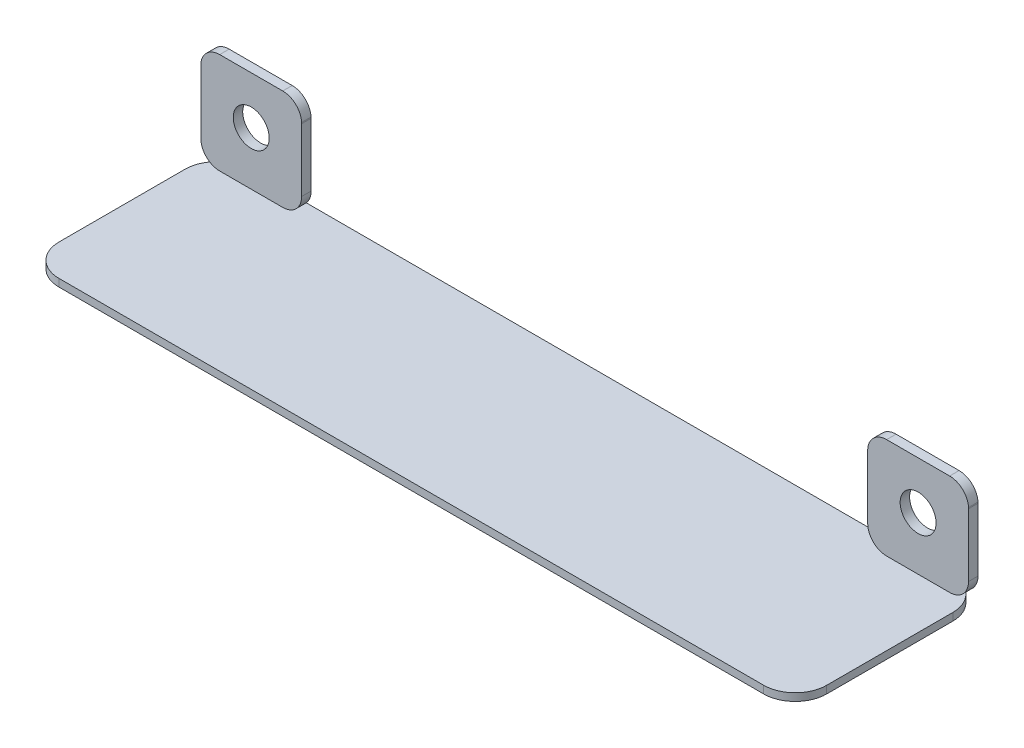
ISO-10303-21;
HEADER;
FILE_DESCRIPTION(('STEP AP214'),'2;1');
FILE_NAME('part.step','',(''),(''),'','','');
FILE_SCHEMA(('AUTOMOTIVE_DESIGN { 1 0 10303 214 1 1 1 1 }'));
ENDSEC;
DATA;
#1=APPLICATION_CONTEXT('core data for automotive mechanical design processes');
#2=APPLICATION_PROTOCOL_DEFINITION('international standard','automotive_design',2000,#1);
#3=PRODUCT_CONTEXT('',#1,'mechanical');
#4=PRODUCT('Part','Part','',(#3));
#5=PRODUCT_RELATED_PRODUCT_CATEGORY('part','',(#4));
#6=PRODUCT_DEFINITION_FORMATION('','',#4);
#7=PRODUCT_DEFINITION_CONTEXT('part definition',#1,'design');
#8=PRODUCT_DEFINITION('design','',#6,#7);
#9=PRODUCT_DEFINITION_SHAPE('','',#8);
#10=(LENGTH_UNIT() NAMED_UNIT(*) SI_UNIT(.MILLI.,.METRE.));
#11=(NAMED_UNIT(*) PLANE_ANGLE_UNIT() SI_UNIT($,.RADIAN.));
#12=(NAMED_UNIT(*) SI_UNIT($,.STERADIAN.) SOLID_ANGLE_UNIT());
#13=UNCERTAINTY_MEASURE_WITH_UNIT(LENGTH_MEASURE(1.E-05),#10,'distance_accuracy_value','');
#14=(GEOMETRIC_REPRESENTATION_CONTEXT(3) GLOBAL_UNCERTAINTY_ASSIGNED_CONTEXT((#13)) GLOBAL_UNIT_ASSIGNED_CONTEXT((#10,
#11,#12)) REPRESENTATION_CONTEXT('',''));
#15=CARTESIAN_POINT('',(0.,0.,0.));
#16=DIRECTION('',(0.,0.,1.));
#17=DIRECTION('',(1.,0.,0.));
#18=AXIS2_PLACEMENT_3D('',#15,#16,#17);
#19=CARTESIAN_POINT('',(0.,-56.3999999999996,0.));
#20=DIRECTION('',(0.,1.,0.));
#21=DIRECTION('',(0.,0.,1.));
#22=AXIS2_PLACEMENT_3D('',#19,#20,#21);
#23=PLANE('',#22);
#24=DIRECTION('',(-1.,0.,0.));
#25=VECTOR('',#24,1.);
#26=CARTESIAN_POINT('',(-7.9999999999992,-56.3999999999996,29.));
#27=LINE('',#26,#25);
#28=CARTESIAN_POINT('',(108.800000000001,-56.3999999999996,29.));
#29=VERTEX_POINT('',#28);
#30=CARTESIAN_POINT('',(-2.9999999999992,-56.3999999999996,29.));
#31=VERTEX_POINT('',#30);
#32=EDGE_CURVE('E318',#29,#31,#27,.T.);
#33=ORIENTED_EDGE('',*,*,#32,.F.);
#34=CARTESIAN_POINT('',(108.800000000001,-56.3999999999996,24.));
#35=DIRECTION('',(0.,1.,0.));
#36=DIRECTION('',(0.,0.,1.));
#37=AXIS2_PLACEMENT_3D('',#34,#35,#36);
#38=CIRCLE('',#37,5.);
#39=CARTESIAN_POINT('',(113.800000000001,-56.3999999999996,24.));
#40=VERTEX_POINT('',#39);
#41=EDGE_CURVE('E424',#29,#40,#38,.T.);
#42=ORIENTED_EDGE('',*,*,#41,.T.);
#43=DIRECTION('',(0.,0.,1.));
#44=VECTOR('',#43,1.);
#45=CARTESIAN_POINT('',(113.800000000001,-56.3999999999996,-0.999999999999986));
#46=LINE('',#45,#44);
#47=CARTESIAN_POINT('',(113.800000000001,-56.3999999999996,4.00000000000001));
#48=VERTEX_POINT('',#47);
#49=EDGE_CURVE('E331',#48,#40,#46,.T.);
#50=ORIENTED_EDGE('',*,*,#49,.F.);
#51=CARTESIAN_POINT('',(108.800000000001,-56.3999999999996,4.00000000000001));
#52=DIRECTION('',(0.,1.,0.));
#53=DIRECTION('',(0.,0.,1.));
#54=AXIS2_PLACEMENT_3D('',#51,#52,#53);
#55=CIRCLE('',#54,5.);
#56=CARTESIAN_POINT('',(108.800000000001,-56.3999999999996,-0.999999999999986));
#57=VERTEX_POINT('',#56);
#58=EDGE_CURVE('E422',#48,#57,#55,.T.);
#59=ORIENTED_EDGE('',*,*,#58,.T.);
#60=DIRECTION('',(1.,0.,0.));
#61=VECTOR('',#60,1.);
#62=CARTESIAN_POINT('',(-7.9999999999992,-56.3999999999996,-0.999999999999987));
#63=LINE('',#62,#61);
#64=CARTESIAN_POINT('',(-2.9999999999992,-56.3999999999996,-0.999999999999987));
#65=VERTEX_POINT('',#64);
#66=EDGE_CURVE('E329',#65,#57,#63,.T.);
#67=ORIENTED_EDGE('',*,*,#66,.F.);
#68=CARTESIAN_POINT('',(-2.9999999999992,-56.3999999999996,4.00000000000001));
#69=DIRECTION('',(0.,1.,0.));
#70=DIRECTION('',(0.,0.,1.));
#71=AXIS2_PLACEMENT_3D('',#68,#69,#70);
#72=CIRCLE('',#71,5.);
#73=CARTESIAN_POINT('',(-7.9999999999992,-56.3999999999996,4.00000000000001));
#74=VERTEX_POINT('',#73);
#75=EDGE_CURVE('E420',#65,#74,#72,.T.);
#76=ORIENTED_EDGE('',*,*,#75,.T.);
#77=DIRECTION('',(0.,0.,-1.));
#78=VECTOR('',#77,1.);
#79=CARTESIAN_POINT('',(-7.9999999999992,-56.3999999999996,-0.999999999999987));
#80=LINE('',#79,#78);
#81=CARTESIAN_POINT('',(-7.9999999999992,-56.3999999999996,24.));
#82=VERTEX_POINT('',#81);
#83=EDGE_CURVE('E313',#82,#74,#80,.T.);
#84=ORIENTED_EDGE('',*,*,#83,.F.);
#85=CARTESIAN_POINT('',(-2.9999999999992,-56.3999999999996,24.));
#86=DIRECTION('',(0.,1.,0.));
#87=DIRECTION('',(0.,0.,1.));
#88=AXIS2_PLACEMENT_3D('',#85,#86,#87);
#89=CIRCLE('',#88,5.);
#90=EDGE_CURVE('E418',#82,#31,#89,.T.);
#91=ORIENTED_EDGE('',*,*,#90,.T.);
#92=EDGE_LOOP('',(#33,#42,#50,#59,#67,#76,#84,#91));
#93=FACE_BOUND('',#92,.T.);
#94=DIRECTION('',(1.,0.,0.));
#95=VECTOR('',#94,1.);
#96=CARTESIAN_POINT('',(-4.9999999999992,-56.3999999999996,0.));
#97=LINE('',#96,#95);
#98=CARTESIAN_POINT('',(-4.9999999999992,-56.3999999999996,0.));
#99=VERTEX_POINT('',#98);
#100=CARTESIAN_POINT('',(5.0000000000008,-56.3999999999996,0.));
#101=VERTEX_POINT('',#100);
#102=EDGE_CURVE('E364',#99,#101,#97,.T.);
#103=ORIENTED_EDGE('',*,*,#102,.T.);
#104=DIRECTION('',(0.,0.,-1.));
#105=VECTOR('',#104,1.);
#106=CARTESIAN_POINT('',(5.0000000000008,-56.3999999999996,24.1274171983992));
#107=LINE('',#106,#105);
#108=CARTESIAN_POINT('',(5.0000000000008,-56.3999999999996,1.50000000000002));
#109=VERTEX_POINT('',#108);
#110=EDGE_CURVE('E391',#109,#101,#107,.T.);
#111=ORIENTED_EDGE('',*,*,#110,.F.);
#112=DIRECTION('',(1.,0.,0.));
#113=VECTOR('',#112,1.);
#114=CARTESIAN_POINT('',(-4.9999999999992,-56.3999999999996,1.50000000000002));
#115=LINE('',#114,#113);
#116=CARTESIAN_POINT('',(-4.9999999999992,-56.3999999999996,1.50000000000002));
#117=VERTEX_POINT('',#116);
#118=EDGE_CURVE('E407',#117,#109,#115,.T.);
#119=ORIENTED_EDGE('',*,*,#118,.F.);
#120=DIRECTION('',(0.,0.,-1.));
#121=VECTOR('',#120,1.);
#122=CARTESIAN_POINT('',(-4.9999999999992,-56.3999999999996,24.1274171983992));
#123=LINE('',#122,#121);
#124=EDGE_CURVE('E394',#117,#99,#123,.T.);
#125=ORIENTED_EDGE('',*,*,#124,.T.);
#126=EDGE_LOOP('',(#103,#111,#119,#125));
#127=FACE_BOUND('',#126,.T.);
#128=DIRECTION('',(0.,0.,-1.));
#129=VECTOR('',#128,1.);
#130=CARTESIAN_POINT('',(100.800000000001,-56.3999999999999,24.1274171983992));
#131=LINE('',#130,#129);
#132=CARTESIAN_POINT('',(100.800000000001,-56.3999999999996,1.50000000000002));
#133=VERTEX_POINT('',#132);
#134=CARTESIAN_POINT('',(100.800000000001,-56.3999999999997,0.));
#135=VERTEX_POINT('',#134);
#136=EDGE_CURVE('E303',#133,#135,#131,.T.);
#137=ORIENTED_EDGE('',*,*,#136,.T.);
#138=DIRECTION('',(1.,0.,0.));
#139=VECTOR('',#138,1.);
#140=CARTESIAN_POINT('',(100.800000000001,-56.3999999999999,0.));
#141=LINE('',#140,#139);
#142=CARTESIAN_POINT('',(110.800000000001,-56.3999999999997,0.));
#143=VERTEX_POINT('',#142);
#144=EDGE_CURVE('E288',#135,#143,#141,.T.);
#145=ORIENTED_EDGE('',*,*,#144,.T.);
#146=DIRECTION('',(0.,0.,-1.));
#147=VECTOR('',#146,1.);
#148=CARTESIAN_POINT('',(110.800000000001,-56.3999999999999,24.1274171983992));
#149=LINE('',#148,#147);
#150=CARTESIAN_POINT('',(110.800000000001,-56.3999999999999,1.50000000000002));
#151=VERTEX_POINT('',#150);
#152=EDGE_CURVE('E300',#151,#143,#149,.T.);
#153=ORIENTED_EDGE('',*,*,#152,.F.);
#154=DIRECTION('',(1.,0.,0.));
#155=VECTOR('',#154,1.);
#156=CARTESIAN_POINT('',(100.800000000001,-56.3999999999999,1.50000000000002));
#157=LINE('',#156,#155);
#158=EDGE_CURVE('E253',#133,#151,#157,.T.);
#159=ORIENTED_EDGE('',*,*,#158,.F.);
#160=EDGE_LOOP('',(#137,#145,#153,#159));
#161=FACE_BOUND('',#160,.T.);
#162=ADVANCED_FACE('F33',(#93,#127,#161),#23,.T.);
#163=CARTESIAN_POINT('',(5.0000000000008,-40.3999999999996,24.1274171983992));
#164=DIRECTION('',(0.,-1.,0.));
#165=DIRECTION('',(1.,0.,0.));
#166=AXIS2_PLACEMENT_3D('',#163,#164,#165);
#167=PLANE('',#166);
#168=DIRECTION('',(-1.,0.,0.));
#169=VECTOR('',#168,1.);
#170=CARTESIAN_POINT('',(5.0000000000008,-40.3999999999996,1.50000000000002));
#171=LINE('',#170,#169);
#172=CARTESIAN_POINT('',(5.0000000000008,-40.3999999999996,1.50000000000002));
#173=VERTEX_POINT('',#172);
#174=CARTESIAN_POINT('',(-4.9999999999992,-40.3999999999996,1.50000000000002));
#175=VERTEX_POINT('',#174);
#176=EDGE_CURVE('E336',#173,#175,#171,.T.);
#177=ORIENTED_EDGE('',*,*,#176,.F.);
#178=DIRECTION('',(0.,0.,-1.));
#179=VECTOR('',#178,1.);
#180=CARTESIAN_POINT('',(5.0000000000008,-40.3999999999996,24.1274171983992));
#181=LINE('',#180,#179);
#182=CARTESIAN_POINT('',(5.0000000000008,-40.3999999999996,0.));
#183=VERTEX_POINT('',#182);
#184=EDGE_CURVE('E383',#173,#183,#181,.T.);
#185=ORIENTED_EDGE('',*,*,#184,.T.);
#186=DIRECTION('',(-1.,0.,0.));
#187=VECTOR('',#186,1.);
#188=CARTESIAN_POINT('',(5.0000000000008,-40.3999999999996,0.));
#189=LINE('',#188,#187);
#190=CARTESIAN_POINT('',(-4.9999999999992,-40.3999999999996,0.));
#191=VERTEX_POINT('',#190);
#192=EDGE_CURVE('E378',#183,#191,#189,.T.);
#193=ORIENTED_EDGE('',*,*,#192,.T.);
#194=DIRECTION('',(0.,0.,-1.));
#195=VECTOR('',#194,1.);
#196=CARTESIAN_POINT('',(-4.9999999999992,-40.3999999999996,24.1274171983992));
#197=LINE('',#196,#195);
#198=EDGE_CURVE('E381',#175,#191,#197,.T.);
#199=ORIENTED_EDGE('',*,*,#198,.F.);
#200=EDGE_LOOP('',(#177,#185,#193,#199));
#201=FACE_BOUND('',#200,.T.);
#202=ADVANCED_FACE('F481',(#201),#167,.F.);
#203=CARTESIAN_POINT('',(5.00130437723496,-43.4012317327787,24.1274171983992));
#204=DIRECTION('',(0.,0.,-1.));
#205=DIRECTION('',(-1.,0.,0.));
#206=AXIS2_PLACEMENT_3D('',#203,#204,#205);
#207=CYLINDRICAL_SURFACE('',#206,3.00123201622932);
#208=CARTESIAN_POINT('',(5.00130437723496,-43.4012317327787,1.50000000000002));
#209=DIRECTION('',(0.,0.,1.));
#210=DIRECTION('',(1.,0.,0.));
#211=AXIS2_PLACEMENT_3D('',#208,#209,#210);
#212=CIRCLE('',#211,3.00123201622932);
#213=CARTESIAN_POINT('',(7.99754057358418,-43.2281356007401,1.50000000000002));
#214=VERTEX_POINT('',#213);
#215=EDGE_CURVE('E340',#214,#173,#212,.T.);
#216=ORIENTED_EDGE('',*,*,#215,.F.);
#217=DIRECTION('',(0.,0.,-1.));
#218=VECTOR('',#217,1.);
#219=CARTESIAN_POINT('',(7.99754057358418,-43.2281356007401,24.1274171983992));
#220=LINE('',#219,#218);
#221=CARTESIAN_POINT('',(7.99754057358418,-43.2281356007401,0.));
#222=VERTEX_POINT('',#221);
#223=EDGE_CURVE('E385',#214,#222,#220,.T.);
#224=ORIENTED_EDGE('',*,*,#223,.T.);
#225=CARTESIAN_POINT('',(5.00130437723496,-43.4012317327787,0.));
#226=DIRECTION('',(0.,0.,1.));
#227=DIRECTION('',(1.,0.,0.));
#228=AXIS2_PLACEMENT_3D('',#225,#226,#227);
#229=CIRCLE('',#228,3.00123201622932);
#230=EDGE_CURVE('E375',#222,#183,#229,.T.);
#231=ORIENTED_EDGE('',*,*,#230,.T.);
#232=ORIENTED_EDGE('',*,*,#184,.F.);
#233=EDGE_LOOP('',(#216,#224,#231,#232));
#234=FACE_BOUND('',#233,.T.);
#235=ADVANCED_FACE('F486',(#234),#207,.T.);
#236=CARTESIAN_POINT('',(8.0000000000008,-43.3999999999996,24.1274171983992));
#237=DIRECTION('',(-0.99989762377146,-0.0143088076438109,0.));
#238=DIRECTION('',(0.0143088076438109,-0.99989762377146,0.));
#239=AXIS2_PLACEMENT_3D('',#236,#237,#238);
#240=PLANE('',#239);
#241=DIRECTION('',(-0.0143088076438109,0.99989762377146,0.));
#242=VECTOR('',#241,1.);
#243=CARTESIAN_POINT('',(8.0000000000008,-43.3999999999996,1.50000000000002));
#244=LINE('',#243,#242);
#245=CARTESIAN_POINT('',(8.0000000000006,-43.3999999999713,1.50000000000002));
#246=VERTEX_POINT('',#245);
#247=EDGE_CURVE('E342',#246,#214,#244,.T.);
#248=ORIENTED_EDGE('',*,*,#247,.F.);
#249=DIRECTION('',(0.,0.,-1.));
#250=VECTOR('',#249,1.);
#251=CARTESIAN_POINT('',(8.0000000000008,-43.3999999999996,24.1274171983992));
#252=LINE('',#251,#250);
#253=CARTESIAN_POINT('',(8.0000000000008,-43.3999999999996,0.));
#254=VERTEX_POINT('',#253);
#255=EDGE_CURVE('E387',#246,#254,#252,.T.);
#256=ORIENTED_EDGE('',*,*,#255,.T.);
#257=DIRECTION('',(-0.0143088076438109,0.99989762377146,0.));
#258=VECTOR('',#257,1.);
#259=CARTESIAN_POINT('',(8.0000000000008,-43.3999999999996,0.));
#260=LINE('',#259,#258);
#261=EDGE_CURVE('E372',#254,#222,#260,.T.);
#262=ORIENTED_EDGE('',*,*,#261,.T.);
#263=ORIENTED_EDGE('',*,*,#223,.F.);
#264=EDGE_LOOP('',(#248,#256,#262,#263));
#265=FACE_BOUND('',#264,.T.);
#266=ADVANCED_FACE('F515',(#265),#240,.F.);
#267=CARTESIAN_POINT('',(8.00000000000081,-53.3999999999996,24.1274171983992));
#268=DIRECTION('',(-1.,0.,0.));
#269=DIRECTION('',(0.,-1.,0.));
#270=AXIS2_PLACEMENT_3D('',#267,#268,#269);
#271=PLANE('',#270);
#272=DIRECTION('',(0.,1.,0.));
#273=VECTOR('',#272,1.);
#274=CARTESIAN_POINT('',(8.00000000000081,-53.3999999999996,1.50000000000002));
#275=LINE('',#274,#273);
#276=CARTESIAN_POINT('',(8.0000000000008,-53.3999999999996,1.50000000000002));
#277=VERTEX_POINT('',#276);
#278=EDGE_CURVE('E345',#277,#246,#275,.T.);
#279=ORIENTED_EDGE('',*,*,#278,.F.);
#280=DIRECTION('',(0.,0.,-1.));
#281=VECTOR('',#280,1.);
#282=CARTESIAN_POINT('',(8.00000000000081,-53.3999999999996,24.1274171983992));
#283=LINE('',#282,#281);
#284=CARTESIAN_POINT('',(8.00000000000081,-53.3999999999996,0.));
#285=VERTEX_POINT('',#284);
#286=EDGE_CURVE('E389',#277,#285,#283,.T.);
#287=ORIENTED_EDGE('',*,*,#286,.T.);
#288=DIRECTION('',(0.,1.,0.));
#289=VECTOR('',#288,1.);
#290=CARTESIAN_POINT('',(8.00000000000081,-53.3999999999996,0.));
#291=LINE('',#290,#289);
#292=EDGE_CURVE('E369',#285,#254,#291,.T.);
#293=ORIENTED_EDGE('',*,*,#292,.T.);
#294=ORIENTED_EDGE('',*,*,#255,.F.);
#295=EDGE_LOOP('',(#279,#287,#293,#294));
#296=FACE_BOUND('',#295,.T.);
#297=ADVANCED_FACE('F519',(#296),#271,.F.);
#298=CARTESIAN_POINT('',(5.0000000000008,-53.3999999999996,24.1274171983992));
#299=DIRECTION('',(0.,0.,-1.));
#300=DIRECTION('',(-1.,0.,0.));
#301=AXIS2_PLACEMENT_3D('',#298,#299,#300);
#302=CYLINDRICAL_SURFACE('',#301,3.);
#303=CARTESIAN_POINT('',(5.0000000000008,-53.3999999999996,1.50000000000002));
#304=DIRECTION('',(0.,0.,1.));
#305=DIRECTION('',(1.,0.,0.));
#306=AXIS2_PLACEMENT_3D('',#303,#304,#305);
#307=CIRCLE('',#306,3.);
#308=EDGE_CURVE('E405',#109,#277,#307,.T.);
#309=ORIENTED_EDGE('',*,*,#308,.F.);
#310=ORIENTED_EDGE('',*,*,#110,.T.);
#311=CARTESIAN_POINT('',(5.0000000000008,-53.3999999999996,0.));
#312=DIRECTION('',(0.,0.,1.));
#313=DIRECTION('',(1.,0.,0.));
#314=AXIS2_PLACEMENT_3D('',#311,#312,#313);
#315=CIRCLE('',#314,3.);
#316=EDGE_CURVE('E366',#101,#285,#315,.T.);
#317=ORIENTED_EDGE('',*,*,#316,.T.);
#318=ORIENTED_EDGE('',*,*,#286,.F.);
#319=EDGE_LOOP('',(#309,#310,#317,#318));
#320=FACE_BOUND('',#319,.T.);
#321=ADVANCED_FACE('F523',(#320),#302,.T.);
#322=CARTESIAN_POINT('',(-4.9999999999992,-53.3999999999996,24.1274171983992));
#323=DIRECTION('',(0.,0.,-1.));
#324=DIRECTION('',(-1.,0.,0.));
#325=AXIS2_PLACEMENT_3D('',#322,#323,#324);
#326=CYLINDRICAL_SURFACE('',#325,3.);
#327=CARTESIAN_POINT('',(-4.9999999999992,-53.3999999999996,1.50000000000002));
#328=DIRECTION('',(0.,0.,1.));
#329=DIRECTION('',(1.,0.,0.));
#330=AXIS2_PLACEMENT_3D('',#327,#328,#329);
#331=CIRCLE('',#330,3.);
#332=CARTESIAN_POINT('',(-7.9999999999992,-53.3999999999996,1.50000000000002));
#333=VERTEX_POINT('',#332);
#334=EDGE_CURVE('E410',#333,#117,#331,.T.);
#335=ORIENTED_EDGE('',*,*,#334,.F.);
#336=DIRECTION('',(0.,0.,-1.));
#337=VECTOR('',#336,1.);
#338=CARTESIAN_POINT('',(-7.9999999999992,-53.3999999999996,24.1274171983992));
#339=LINE('',#338,#337);
#340=CARTESIAN_POINT('',(-7.9999999999992,-53.3999999999996,0.));
#341=VERTEX_POINT('',#340);
#342=EDGE_CURVE('E396',#333,#341,#339,.T.);
#343=ORIENTED_EDGE('',*,*,#342,.T.);
#344=CARTESIAN_POINT('',(-4.9999999999992,-53.3999999999996,0.));
#345=DIRECTION('',(0.,0.,1.));
#346=DIRECTION('',(1.,0.,0.));
#347=AXIS2_PLACEMENT_3D('',#344,#345,#346);
#348=CIRCLE('',#347,3.);
#349=EDGE_CURVE('E361',#341,#99,#348,.T.);
#350=ORIENTED_EDGE('',*,*,#349,.T.);
#351=ORIENTED_EDGE('',*,*,#124,.F.);
#352=EDGE_LOOP('',(#335,#343,#350,#351));
#353=FACE_BOUND('',#352,.T.);
#354=ADVANCED_FACE('F527',(#353),#326,.T.);
#355=CARTESIAN_POINT('',(-7.9999999999992,-43.3999999999996,24.1274171983992));
#356=DIRECTION('',(1.,0.,0.));
#357=DIRECTION('',(0.,0.,-1.));
#358=AXIS2_PLACEMENT_3D('',#355,#356,#357);
#359=PLANE('',#358);
#360=DIRECTION('',(0.,-1.,0.));
#361=VECTOR('',#360,1.);
#362=CARTESIAN_POINT('',(-7.9999999999992,-43.3999999999996,1.50000000000002));
#363=LINE('',#362,#361);
#364=CARTESIAN_POINT('',(-7.9999999999992,-43.3999999999996,1.50000000000002));
#365=VERTEX_POINT('',#364);
#366=EDGE_CURVE('E349',#365,#333,#363,.T.);
#367=ORIENTED_EDGE('',*,*,#366,.F.);
#368=DIRECTION('',(0.,0.,-1.));
#369=VECTOR('',#368,1.);
#370=CARTESIAN_POINT('',(-7.9999999999992,-43.3999999999996,24.1274171983992));
#371=LINE('',#370,#369);
#372=CARTESIAN_POINT('',(-7.9999999999992,-43.3999999999996,0.));
#373=VERTEX_POINT('',#372);
#374=EDGE_CURVE('E398',#365,#373,#371,.T.);
#375=ORIENTED_EDGE('',*,*,#374,.T.);
#376=DIRECTION('',(0.,-1.,0.));
#377=VECTOR('',#376,1.);
#378=CARTESIAN_POINT('',(-7.9999999999992,-43.3999999999996,0.));
#379=LINE('',#378,#377);
#380=EDGE_CURVE('E358',#373,#341,#379,.T.);
#381=ORIENTED_EDGE('',*,*,#380,.T.);
#382=ORIENTED_EDGE('',*,*,#342,.F.);
#383=EDGE_LOOP('',(#367,#375,#381,#382));
#384=FACE_BOUND('',#383,.T.);
#385=ADVANCED_FACE('F531',(#384),#359,.F.);
#386=CARTESIAN_POINT('',(-7.99754057358258,-43.2281356007401,24.1274171983992));
#387=DIRECTION('',(0.999897623771461,-0.0143088076437801,0.));
#388=DIRECTION('',(0.0143088076437801,0.999897623771461,0.));
#389=AXIS2_PLACEMENT_3D('',#386,#387,#388);
#390=PLANE('',#389);
#391=DIRECTION('',(-0.0143088076437801,-0.999897623771461,0.));
#392=VECTOR('',#391,1.);
#393=CARTESIAN_POINT('',(-7.99754057358258,-43.2281356007401,1.50000000000002));
#394=LINE('',#393,#392);
#395=CARTESIAN_POINT('',(-7.99754057358258,-43.2281356007401,1.50000000000002));
#396=VERTEX_POINT('',#395);
#397=EDGE_CURVE('E347',#396,#365,#394,.T.);
#398=ORIENTED_EDGE('',*,*,#397,.F.);
#399=DIRECTION('',(0.,0.,-1.));
#400=VECTOR('',#399,1.);
#401=CARTESIAN_POINT('',(-7.99754057358258,-43.2281356007401,24.1274171983992));
#402=LINE('',#401,#400);
#403=CARTESIAN_POINT('',(-7.99754057358258,-43.2281356007401,0.));
#404=VERTEX_POINT('',#403);
#405=EDGE_CURVE('E343',#396,#404,#402,.T.);
#406=ORIENTED_EDGE('',*,*,#405,.T.);
#407=DIRECTION('',(-0.0143088076437801,-0.999897623771461,0.));
#408=VECTOR('',#407,1.);
#409=CARTESIAN_POINT('',(-7.99754057358258,-43.2281356007401,0.));
#410=LINE('',#409,#408);
#411=EDGE_CURVE('E355',#404,#373,#410,.T.);
#412=ORIENTED_EDGE('',*,*,#411,.T.);
#413=ORIENTED_EDGE('',*,*,#374,.F.);
#414=EDGE_LOOP('',(#398,#406,#412,#413));
#415=FACE_BOUND('',#414,.T.);
#416=ADVANCED_FACE('F535',(#415),#390,.F.);
#417=CARTESIAN_POINT('',(-5.00130437723336,-43.4012317327786,24.1274171983992));
#418=DIRECTION('',(0.,0.,-1.));
#419=DIRECTION('',(-1.,0.,0.));
#420=AXIS2_PLACEMENT_3D('',#417,#418,#419);
#421=CYLINDRICAL_SURFACE('',#420,3.00123201622933);
#422=CARTESIAN_POINT('',(-5.00130437723336,-43.4012317327786,1.50000000000002));
#423=DIRECTION('',(0.,0.,1.));
#424=DIRECTION('',(1.,0.,0.));
#425=AXIS2_PLACEMENT_3D('',#422,#423,#424);
#426=CIRCLE('',#425,3.00123201622933);
#427=EDGE_CURVE('E339',#175,#396,#426,.T.);
#428=ORIENTED_EDGE('',*,*,#427,.F.);
#429=ORIENTED_EDGE('',*,*,#198,.T.);
#430=CARTESIAN_POINT('',(-5.00130437723336,-43.4012317327786,0.));
#431=DIRECTION('',(0.,0.,1.));
#432=DIRECTION('',(1.,0.,0.));
#433=AXIS2_PLACEMENT_3D('',#430,#431,#432);
#434=CIRCLE('',#433,3.00123201622933);
#435=EDGE_CURVE('E352',#191,#404,#434,.T.);
#436=ORIENTED_EDGE('',*,*,#435,.T.);
#437=ORIENTED_EDGE('',*,*,#405,.F.);
#438=EDGE_LOOP('',(#428,#429,#436,#437));
#439=FACE_BOUND('',#438,.T.);
#440=ADVANCED_FACE('F510',(#439),#421,.T.);
#441=CARTESIAN_POINT('',(-5.00130437723336,-43.4012317327786,0.));
#442=DIRECTION('',(0.,0.,1.));
#443=DIRECTION('',(1.,0.,0.));
#444=AXIS2_PLACEMENT_3D('',#441,#442,#443);
#445=PLANE('',#444);
#446=ORIENTED_EDGE('',*,*,#435,.F.);
#447=ORIENTED_EDGE('',*,*,#192,.F.);
#448=ORIENTED_EDGE('',*,*,#230,.F.);
#449=ORIENTED_EDGE('',*,*,#261,.F.);
#450=ORIENTED_EDGE('',*,*,#292,.F.);
#451=ORIENTED_EDGE('',*,*,#316,.F.);
#452=ORIENTED_EDGE('',*,*,#102,.F.);
#453=ORIENTED_EDGE('',*,*,#349,.F.);
#454=ORIENTED_EDGE('',*,*,#380,.F.);
#455=ORIENTED_EDGE('',*,*,#411,.F.);
#456=EDGE_LOOP('',(#446,#447,#448,#449,#450,#451,#452,#453,#454,#455));
#457=FACE_BOUND('',#456,.T.);
#458=CARTESIAN_POINT('',(8.04911692853238E-13,-47.9523811542372,0.));
#459=DIRECTION('',(0.,0.,1.));
#460=DIRECTION('',(1.,0.,0.));
#461=AXIS2_PLACEMENT_3D('',#458,#459,#460);
#462=CIRCLE('',#461,2.85);
#463=CARTESIAN_POINT('',(2.8500000000008,-47.9523811542372,0.));
#464=VERTEX_POINT('',#463);
#465=EDGE_CURVE('E326',#464,#464,#462,.T.);
#466=ORIENTED_EDGE('',*,*,#465,.T.);
#467=EDGE_LOOP('',(#466));
#468=FACE_BOUND('',#467,.T.);
#469=ADVANCED_FACE('F507',(#457,#468),#445,.F.);
#470=CARTESIAN_POINT('',(8.04911692853238E-13,-47.9523811542372,24.1274171983992));
#471=DIRECTION('',(0.,0.,-1.));
#472=DIRECTION('',(-1.,0.,0.));
#473=AXIS2_PLACEMENT_3D('',#470,#471,#472);
#474=CYLINDRICAL_SURFACE('',#473,2.85);
#475=ORIENTED_EDGE('',*,*,#465,.F.);
#476=EDGE_LOOP('',(#475));
#477=FACE_BOUND('',#476,.T.);
#478=CARTESIAN_POINT('',(8.04911692853238E-13,-47.9523811542372,1.50000000000002));
#479=DIRECTION('',(0.,0.,1.));
#480=DIRECTION('',(1.,0.,0.));
#481=AXIS2_PLACEMENT_3D('',#478,#479,#480);
#482=CIRCLE('',#481,2.85);
#483=CARTESIAN_POINT('',(2.8500000000008,-47.9523811542372,1.50000000000002));
#484=VERTEX_POINT('',#483);
#485=EDGE_CURVE('E338',#484,#484,#482,.T.);
#486=ORIENTED_EDGE('',*,*,#485,.T.);
#487=EDGE_LOOP('',(#486));
#488=FACE_BOUND('',#487,.T.);
#489=ADVANCED_FACE('F503',(#477,#488),#474,.F.);
#490=CARTESIAN_POINT('',(8.04911692853238E-13,3.88578058618805E-13,1.50000000000002));
#491=DIRECTION('',(0.,0.,1.));
#492=DIRECTION('',(0.,-1.,0.));
#493=AXIS2_PLACEMENT_3D('',#490,#491,#492);
#494=PLANE('',#493);
#495=ORIENTED_EDGE('',*,*,#485,.F.);
#496=EDGE_LOOP('',(#495));
#497=FACE_BOUND('',#496,.T.);
#498=ORIENTED_EDGE('',*,*,#397,.T.);
#499=ORIENTED_EDGE('',*,*,#366,.T.);
#500=ORIENTED_EDGE('',*,*,#334,.T.);
#501=ORIENTED_EDGE('',*,*,#118,.T.);
#502=ORIENTED_EDGE('',*,*,#308,.T.);
#503=ORIENTED_EDGE('',*,*,#278,.T.);
#504=ORIENTED_EDGE('',*,*,#247,.T.);
#505=ORIENTED_EDGE('',*,*,#215,.T.);
#506=ORIENTED_EDGE('',*,*,#176,.T.);
#507=ORIENTED_EDGE('',*,*,#427,.T.);
#508=EDGE_LOOP('',(#498,#499,#500,#501,#502,#503,#504,#505,#506,#507));
#509=FACE_BOUND('',#508,.T.);
#510=ADVANCED_FACE('F500',(#497,#509),#494,.T.);
#511=CARTESIAN_POINT('',(-7.9999999999992,-57.5999999999996,-0.999999999999987));
#512=DIRECTION('',(1.,0.,0.));
#513=DIRECTION('',(0.,0.,-1.));
#514=AXIS2_PLACEMENT_3D('',#511,#512,#513);
#515=PLANE('',#514);
#516=ORIENTED_EDGE('',*,*,#83,.T.);
#517=DIRECTION('',(0.,1.,0.));
#518=VECTOR('',#517,1.);
#519=CARTESIAN_POINT('',(-7.9999999999992,-57.5999999999996,4.00000000000001));
#520=LINE('',#519,#518);
#521=CARTESIAN_POINT('',(-7.9999999999992,-57.5999999999996,4.00000000000001));
#522=VERTEX_POINT('',#521);
#523=EDGE_CURVE('E11',#74,#522,#520,.F.);
#524=ORIENTED_EDGE('',*,*,#523,.T.);
#525=DIRECTION('',(0.,0.,-1.));
#526=VECTOR('',#525,1.);
#527=CARTESIAN_POINT('',(-7.9999999999992,-57.5999999999996,-0.999999999999987));
#528=LINE('',#527,#526);
#529=CARTESIAN_POINT('',(-7.9999999999992,-57.5999999999996,24.));
#530=VERTEX_POINT('',#529);
#531=EDGE_CURVE('E315',#530,#522,#528,.T.);
#532=ORIENTED_EDGE('',*,*,#531,.F.);
#533=DIRECTION('',(0.,1.,0.));
#534=VECTOR('',#533,1.);
#535=CARTESIAN_POINT('',(-7.9999999999992,-57.5999999999996,24.));
#536=LINE('',#535,#534);
#537=EDGE_CURVE('E41',#530,#82,#536,.T.);
#538=ORIENTED_EDGE('',*,*,#537,.T.);
#539=EDGE_LOOP('',(#516,#524,#532,#538));
#540=FACE_BOUND('',#539,.T.);
#541=ADVANCED_FACE('F446',(#540),#515,.F.);
#542=CARTESIAN_POINT('',(-7.9999999999992,-57.5999999999996,-0.999999999999987));
#543=DIRECTION('',(0.,0.,1.));
#544=DIRECTION('',(1.,0.,0.));
#545=AXIS2_PLACEMENT_3D('',#542,#543,#544);
#546=PLANE('',#545);
#547=ORIENTED_EDGE('',*,*,#66,.T.);
#548=DIRECTION('',(0.,1.,0.));
#549=VECTOR('',#548,1.);
#550=CARTESIAN_POINT('',(108.800000000001,-57.5999999999996,-0.999999999999986));
#551=LINE('',#550,#549);
#552=CARTESIAN_POINT('',(108.800000000001,-57.5999999999996,-0.999999999999986));
#553=VERTEX_POINT('',#552);
#554=EDGE_CURVE('E48',#57,#553,#551,.F.);
#555=ORIENTED_EDGE('',*,*,#554,.T.);
#556=DIRECTION('',(1.,0.,0.));
#557=VECTOR('',#556,1.);
#558=CARTESIAN_POINT('',(-7.9999999999992,-57.5999999999996,-0.999999999999987));
#559=LINE('',#558,#557);
#560=CARTESIAN_POINT('',(-2.9999999999992,-57.5999999999996,-0.999999999999987));
#561=VERTEX_POINT('',#560);
#562=EDGE_CURVE('E317',#561,#553,#559,.T.);
#563=ORIENTED_EDGE('',*,*,#562,.F.);
#564=DIRECTION('',(0.,1.,0.));
#565=VECTOR('',#564,1.);
#566=CARTESIAN_POINT('',(-2.9999999999992,-57.5999999999996,-0.999999999999987));
#567=LINE('',#566,#565);
#568=EDGE_CURVE('E438',#561,#65,#567,.T.);
#569=ORIENTED_EDGE('',*,*,#568,.T.);
#570=EDGE_LOOP('',(#547,#555,#563,#569));
#571=FACE_BOUND('',#570,.T.);
#572=ADVANCED_FACE('F457',(#571),#546,.F.);
#573=CARTESIAN_POINT('',(113.800000000001,-57.5999999999996,-0.999999999999986));
#574=DIRECTION('',(-1.,0.,0.));
#575=DIRECTION('',(0.,0.,1.));
#576=AXIS2_PLACEMENT_3D('',#573,#574,#575);
#577=PLANE('',#576);
#578=ORIENTED_EDGE('',*,*,#49,.T.);
#579=DIRECTION('',(0.,1.,0.));
#580=VECTOR('',#579,1.);
#581=CARTESIAN_POINT('',(113.800000000001,-57.5999999999996,24.));
#582=LINE('',#581,#580);
#583=CARTESIAN_POINT('',(113.800000000001,-57.5999999999996,24.));
#584=VERTEX_POINT('',#583);
#585=EDGE_CURVE('E429',#40,#584,#582,.F.);
#586=ORIENTED_EDGE('',*,*,#585,.T.);
#587=DIRECTION('',(0.,0.,1.));
#588=VECTOR('',#587,1.);
#589=CARTESIAN_POINT('',(113.800000000001,-57.5999999999996,-0.999999999999986));
#590=LINE('',#589,#588);
#591=CARTESIAN_POINT('',(113.800000000001,-57.5999999999996,4.00000000000001));
#592=VERTEX_POINT('',#591);
#593=EDGE_CURVE('E320',#592,#584,#590,.T.);
#594=ORIENTED_EDGE('',*,*,#593,.F.);
#595=DIRECTION('',(0.,1.,0.));
#596=VECTOR('',#595,1.);
#597=CARTESIAN_POINT('',(113.800000000001,-57.5999999999996,4.00000000000001));
#598=LINE('',#597,#596);
#599=EDGE_CURVE('E426',#592,#48,#598,.T.);
#600=ORIENTED_EDGE('',*,*,#599,.T.);
#601=EDGE_LOOP('',(#578,#586,#594,#600));
#602=FACE_BOUND('',#601,.T.);
#603=ADVANCED_FACE('F466',(#602),#577,.F.);
#604=CARTESIAN_POINT('',(-7.9999999999992,-57.5999999999996,29.));
#605=DIRECTION('',(0.,0.,-1.));
#606=DIRECTION('',(-1.,0.,0.));
#607=AXIS2_PLACEMENT_3D('',#604,#605,#606);
#608=PLANE('',#607);
#609=DIRECTION('',(-1.,0.,0.));
#610=VECTOR('',#609,1.);
#611=CARTESIAN_POINT('',(-7.9999999999992,-57.5999999999996,29.));
#612=LINE('',#611,#610);
#613=CARTESIAN_POINT('',(108.800000000001,-57.5999999999996,29.));
#614=VERTEX_POINT('',#613);
#615=CARTESIAN_POINT('',(-2.9999999999992,-57.5999999999996,29.));
#616=VERTEX_POINT('',#615);
#617=EDGE_CURVE('E323',#614,#616,#612,.T.);
#618=ORIENTED_EDGE('',*,*,#617,.F.);
#619=DIRECTION('',(0.,1.,0.));
#620=VECTOR('',#619,1.);
#621=CARTESIAN_POINT('',(108.800000000001,-57.5999999999996,29.));
#622=LINE('',#621,#620);
#623=EDGE_CURVE('E415',#614,#29,#622,.T.);
#624=ORIENTED_EDGE('',*,*,#623,.T.);
#625=ORIENTED_EDGE('',*,*,#32,.T.);
#626=DIRECTION('',(0.,1.,0.));
#627=VECTOR('',#626,1.);
#628=CARTESIAN_POINT('',(-2.9999999999992,-57.5999999999996,29.));
#629=LINE('',#628,#627);
#630=EDGE_CURVE('E403',#31,#616,#629,.F.);
#631=ORIENTED_EDGE('',*,*,#630,.T.);
#632=EDGE_LOOP('',(#618,#624,#625,#631));
#633=FACE_BOUND('',#632,.T.);
#634=ADVANCED_FACE('F474',(#633),#608,.F.);
#635=CARTESIAN_POINT('',(0.,-57.5999999999996,0.));
#636=DIRECTION('',(0.,1.,0.));
#637=DIRECTION('',(0.,0.,1.));
#638=AXIS2_PLACEMENT_3D('',#635,#636,#637);
#639=PLANE('',#638);
#640=ORIENTED_EDGE('',*,*,#593,.T.);
#641=CARTESIAN_POINT('',(108.800000000001,-57.5999999999996,24.));
#642=DIRECTION('',(0.,1.,0.));
#643=DIRECTION('',(0.,0.,1.));
#644=AXIS2_PLACEMENT_3D('',#641,#642,#643);
#645=CIRCLE('',#644,5.);
#646=EDGE_CURVE('E436',#584,#614,#645,.F.);
#647=ORIENTED_EDGE('',*,*,#646,.T.);
#648=ORIENTED_EDGE('',*,*,#617,.T.);
#649=CARTESIAN_POINT('',(-2.9999999999992,-57.5999999999996,24.));
#650=DIRECTION('',(0.,1.,0.));
#651=DIRECTION('',(0.,0.,1.));
#652=AXIS2_PLACEMENT_3D('',#649,#650,#651);
#653=CIRCLE('',#652,5.);
#654=EDGE_CURVE('E431',#616,#530,#653,.F.);
#655=ORIENTED_EDGE('',*,*,#654,.T.);
#656=ORIENTED_EDGE('',*,*,#531,.T.);
#657=CARTESIAN_POINT('',(-2.9999999999992,-57.5999999999996,4.00000000000001));
#658=DIRECTION('',(0.,1.,0.));
#659=DIRECTION('',(0.,0.,1.));
#660=AXIS2_PLACEMENT_3D('',#657,#658,#659);
#661=CIRCLE('',#660,5.);
#662=EDGE_CURVE('E55',#522,#561,#661,.F.);
#663=ORIENTED_EDGE('',*,*,#662,.T.);
#664=ORIENTED_EDGE('',*,*,#562,.T.);
#665=CARTESIAN_POINT('',(108.800000000001,-57.5999999999996,4.00000000000001));
#666=DIRECTION('',(0.,1.,0.));
#667=DIRECTION('',(0.,0.,1.));
#668=AXIS2_PLACEMENT_3D('',#665,#666,#667);
#669=CIRCLE('',#668,5.);
#670=EDGE_CURVE('E434',#553,#592,#669,.F.);
#671=ORIENTED_EDGE('',*,*,#670,.T.);
#672=EDGE_LOOP('',(#640,#647,#648,#655,#656,#663,#664,#671));
#673=FACE_BOUND('',#672,.T.);
#674=ADVANCED_FACE('F459',(#673),#639,.F.);
#675=CARTESIAN_POINT('',(113.800000000001,-43.3999999999999,24.1274171983992));
#676=DIRECTION('',(-0.999897623771461,-0.0143088076437907,0.));
#677=DIRECTION('',(0.0143088076437907,-0.999897623771461,0.));
#678=AXIS2_PLACEMENT_3D('',#675,#676,#677);
#679=PLANE('',#678);
#680=DIRECTION('',(-0.0143088076437907,0.999897623771461,0.));
#681=VECTOR('',#680,1.);
#682=CARTESIAN_POINT('',(113.800000000001,-43.3999999999999,1.50000000000002));
#683=LINE('',#682,#681);
#684=CARTESIAN_POINT('',(113.800000000001,-43.3999999999999,1.50000000000002));
#685=VERTEX_POINT('',#684);
#686=CARTESIAN_POINT('',(113.797540573584,-43.2281356007404,1.50000000000002));
#687=VERTEX_POINT('',#686);
#688=EDGE_CURVE('E223',#685,#687,#683,.T.);
#689=ORIENTED_EDGE('',*,*,#688,.F.);
#690=DIRECTION('',(0.,0.,-1.));
#691=VECTOR('',#690,1.);
#692=CARTESIAN_POINT('',(113.800000000001,-43.3999999999999,24.1274171983992));
#693=LINE('',#692,#691);
#694=CARTESIAN_POINT('',(113.800000000001,-43.3999999999999,0.));
#695=VERTEX_POINT('',#694);
#696=EDGE_CURVE('E230',#685,#695,#693,.T.);
#697=ORIENTED_EDGE('',*,*,#696,.T.);
#698=DIRECTION('',(-0.0143088076437907,0.999897623771461,0.));
#699=VECTOR('',#698,1.);
#700=CARTESIAN_POINT('',(113.800000000001,-43.3999999999999,0.));
#701=LINE('',#700,#699);
#702=CARTESIAN_POINT('',(113.797540573584,-43.2281356007404,0.));
#703=VERTEX_POINT('',#702);
#704=EDGE_CURVE('E226',#695,#703,#701,.T.);
#705=ORIENTED_EDGE('',*,*,#704,.T.);
#706=DIRECTION('',(0.,0.,-1.));
#707=VECTOR('',#706,1.);
#708=CARTESIAN_POINT('',(113.797540573584,-43.2281356007404,24.1274171983992));
#709=LINE('',#708,#707);
#710=EDGE_CURVE('E219',#687,#703,#709,.T.);
#711=ORIENTED_EDGE('',*,*,#710,.F.);
#712=EDGE_LOOP('',(#689,#697,#705,#711));
#713=FACE_BOUND('',#712,.T.);
#714=ADVANCED_FACE('F221',(#713),#679,.F.);
#715=CARTESIAN_POINT('',(113.800000000001,-53.3999999999999,24.1274171983992));
#716=DIRECTION('',(-1.,0.,0.));
#717=DIRECTION('',(0.,-1.,0.));
#718=AXIS2_PLACEMENT_3D('',#715,#716,#717);
#719=PLANE('',#718);
#720=DIRECTION('',(0.,1.,0.));
#721=VECTOR('',#720,1.);
#722=CARTESIAN_POINT('',(113.800000000001,-53.3999999999999,1.50000000000002));
#723=LINE('',#722,#721);
#724=CARTESIAN_POINT('',(113.800000000001,-53.3999999999999,1.50000000000002));
#725=VERTEX_POINT('',#724);
#726=EDGE_CURVE('E244',#725,#685,#723,.T.);
#727=ORIENTED_EDGE('',*,*,#726,.F.);
#728=DIRECTION('',(0.,0.,-1.));
#729=VECTOR('',#728,1.);
#730=CARTESIAN_POINT('',(113.800000000001,-53.3999999999999,24.1274171983992));
#731=LINE('',#730,#729);
#732=CARTESIAN_POINT('',(113.800000000001,-53.3999999999999,0.));
#733=VERTEX_POINT('',#732);
#734=EDGE_CURVE('E298',#725,#733,#731,.T.);
#735=ORIENTED_EDGE('',*,*,#734,.T.);
#736=DIRECTION('',(0.,1.,0.));
#737=VECTOR('',#736,1.);
#738=CARTESIAN_POINT('',(113.800000000001,-53.3999999999999,0.));
#739=LINE('',#738,#737);
#740=EDGE_CURVE('E293',#733,#695,#739,.T.);
#741=ORIENTED_EDGE('',*,*,#740,.T.);
#742=ORIENTED_EDGE('',*,*,#696,.F.);
#743=EDGE_LOOP('',(#727,#735,#741,#742));
#744=FACE_BOUND('',#743,.T.);
#745=ADVANCED_FACE('F682',(#744),#719,.F.);
#746=CARTESIAN_POINT('',(110.800000000001,-53.3999999999999,24.1274171983992));
#747=DIRECTION('',(0.,0.,-1.));
#748=DIRECTION('',(-1.,0.,0.));
#749=AXIS2_PLACEMENT_3D('',#746,#747,#748);
#750=CYLINDRICAL_SURFACE('',#749,3.);
#751=CARTESIAN_POINT('',(110.800000000001,-53.3999999999999,1.50000000000002));
#752=DIRECTION('',(0.,0.,1.));
#753=DIRECTION('',(1.,0.,0.));
#754=AXIS2_PLACEMENT_3D('',#751,#752,#753);
#755=CIRCLE('',#754,3.);
#756=EDGE_CURVE('E247',#151,#725,#755,.T.);
#757=ORIENTED_EDGE('',*,*,#756,.F.);
#758=ORIENTED_EDGE('',*,*,#152,.T.);
#759=CARTESIAN_POINT('',(110.800000000001,-53.3999999999999,0.));
#760=DIRECTION('',(0.,0.,1.));
#761=DIRECTION('',(1.,0.,0.));
#762=AXIS2_PLACEMENT_3D('',#759,#760,#761);
#763=CIRCLE('',#762,3.);
#764=EDGE_CURVE('E290',#143,#733,#763,.T.);
#765=ORIENTED_EDGE('',*,*,#764,.T.);
#766=ORIENTED_EDGE('',*,*,#734,.F.);
#767=EDGE_LOOP('',(#757,#758,#765,#766));
#768=FACE_BOUND('',#767,.T.);
#769=ADVANCED_FACE('F673',(#768),#750,.T.);
#770=CARTESIAN_POINT('',(100.800000000001,-53.3999999999999,24.1274171983992));
#771=DIRECTION('',(0.,0.,-1.));
#772=DIRECTION('',(-1.,0.,0.));
#773=AXIS2_PLACEMENT_3D('',#770,#771,#772);
#774=CYLINDRICAL_SURFACE('',#773,2.99999999999999);
#775=CARTESIAN_POINT('',(100.800000000001,-53.3999999999999,1.50000000000002));
#776=DIRECTION('',(0.,0.,1.));
#777=DIRECTION('',(1.,0.,0.));
#778=AXIS2_PLACEMENT_3D('',#775,#776,#777);
#779=CIRCLE('',#778,2.99999999999999);
#780=CARTESIAN_POINT('',(97.8000000000005,-53.3999999999999,1.50000000000002));
#781=VERTEX_POINT('',#780);
#782=EDGE_CURVE('E256',#781,#133,#779,.T.);
#783=ORIENTED_EDGE('',*,*,#782,.F.);
#784=DIRECTION('',(0.,0.,-1.));
#785=VECTOR('',#784,1.);
#786=CARTESIAN_POINT('',(97.8000000000005,-53.3999999999999,24.1274171983992));
#787=LINE('',#786,#785);
#788=CARTESIAN_POINT('',(97.8000000000005,-53.3999999999999,0.));
#789=VERTEX_POINT('',#788);
#790=EDGE_CURVE('E305',#781,#789,#787,.T.);
#791=ORIENTED_EDGE('',*,*,#790,.T.);
#792=CARTESIAN_POINT('',(100.800000000001,-53.3999999999999,0.));
#793=DIRECTION('',(0.,0.,1.));
#794=DIRECTION('',(1.,0.,0.));
#795=AXIS2_PLACEMENT_3D('',#792,#793,#794);
#796=CIRCLE('',#795,2.99999999999999);
#797=EDGE_CURVE('E285',#789,#135,#796,.T.);
#798=ORIENTED_EDGE('',*,*,#797,.T.);
#799=ORIENTED_EDGE('',*,*,#136,.F.);
#800=EDGE_LOOP('',(#783,#791,#798,#799));
#801=FACE_BOUND('',#800,.T.);
#802=ADVANCED_FACE('F664',(#801),#774,.T.);
#803=CARTESIAN_POINT('',(97.8000000000005,-43.3999999999999,24.1274171983992));
#804=DIRECTION('',(1.,0.,0.));
#805=DIRECTION('',(0.,0.,-1.));
#806=AXIS2_PLACEMENT_3D('',#803,#804,#805);
#807=PLANE('',#806);
#808=DIRECTION('',(0.,-1.,0.));
#809=VECTOR('',#808,1.);
#810=CARTESIAN_POINT('',(97.8000000000005,-43.3999999999999,1.50000000000002));
#811=LINE('',#810,#809);
#812=CARTESIAN_POINT('',(97.8000000000005,-43.3999999999999,1.50000000000002));
#813=VERTEX_POINT('',#812);
#814=EDGE_CURVE('E259',#813,#781,#811,.T.);
#815=ORIENTED_EDGE('',*,*,#814,.F.);
#816=DIRECTION('',(0.,0.,-1.));
#817=VECTOR('',#816,1.);
#818=CARTESIAN_POINT('',(97.8000000000005,-43.3999999999999,24.1274171983992));
#819=LINE('',#818,#817);
#820=CARTESIAN_POINT('',(97.8000000000005,-43.3999999999999,0.));
#821=VERTEX_POINT('',#820);
#822=EDGE_CURVE('E307',#813,#821,#819,.T.);
#823=ORIENTED_EDGE('',*,*,#822,.T.);
#824=DIRECTION('',(0.,-1.,0.));
#825=VECTOR('',#824,1.);
#826=CARTESIAN_POINT('',(97.8000000000005,-43.3999999999999,0.));
#827=LINE('',#826,#825);
#828=EDGE_CURVE('E282',#821,#789,#827,.T.);
#829=ORIENTED_EDGE('',*,*,#828,.T.);
#830=ORIENTED_EDGE('',*,*,#790,.F.);
#831=EDGE_LOOP('',(#815,#823,#829,#830));
#832=FACE_BOUND('',#831,.T.);
#833=ADVANCED_FACE('F655',(#832),#807,.F.);
#834=CARTESIAN_POINT('',(97.8024594264171,-43.2281356007404,24.1274171983992));
#835=DIRECTION('',(0.999897623771461,-0.0143088076437907,0.));
#836=DIRECTION('',(0.0143088076437907,0.999897623771461,0.));
#837=AXIS2_PLACEMENT_3D('',#834,#835,#836);
#838=PLANE('',#837);
#839=DIRECTION('',(-0.0143088076437907,-0.999897623771461,0.));
#840=VECTOR('',#839,1.);
#841=CARTESIAN_POINT('',(97.8024594264171,-43.2281356007404,1.50000000000002));
#842=LINE('',#841,#840);
#843=CARTESIAN_POINT('',(97.8024594264171,-43.2281356007404,1.50000000000002));
#844=VERTEX_POINT('',#843);
#845=EDGE_CURVE('E262',#844,#813,#842,.T.);
#846=ORIENTED_EDGE('',*,*,#845,.F.);
#847=DIRECTION('',(0.,0.,-1.));
#848=VECTOR('',#847,1.);
#849=CARTESIAN_POINT('',(97.8024594264171,-43.2281356007404,24.1274171983992));
#850=LINE('',#849,#848);
#851=CARTESIAN_POINT('',(97.8024594264171,-43.2281356007404,0.));
#852=VERTEX_POINT('',#851);
#853=EDGE_CURVE('E309',#844,#852,#850,.T.);
#854=ORIENTED_EDGE('',*,*,#853,.T.);
#855=DIRECTION('',(-0.0143088076437907,-0.999897623771461,0.));
#856=VECTOR('',#855,1.);
#857=CARTESIAN_POINT('',(97.8024594264171,-43.2281356007404,0.));
#858=LINE('',#857,#856);
#859=EDGE_CURVE('E279',#852,#821,#858,.T.);
#860=ORIENTED_EDGE('',*,*,#859,.T.);
#861=ORIENTED_EDGE('',*,*,#822,.F.);
#862=EDGE_LOOP('',(#846,#854,#860,#861));
#863=FACE_BOUND('',#862,.T.);
#864=ADVANCED_FACE('F646',(#863),#838,.F.);
#865=CARTESIAN_POINT('',(100.798695622766,-43.401231732779,24.1274171983992));
#866=DIRECTION('',(0.,0.,-1.));
#867=DIRECTION('',(-1.,0.,0.));
#868=AXIS2_PLACEMENT_3D('',#865,#866,#867);
#869=CYLINDRICAL_SURFACE('',#868,3.00123201622944);
#870=CARTESIAN_POINT('',(100.798695622766,-43.401231732779,1.50000000000002));
#871=DIRECTION('',(0.,0.,1.));
#872=DIRECTION('',(1.,0.,0.));
#873=AXIS2_PLACEMENT_3D('',#870,#871,#872);
#874=CIRCLE('',#873,3.00123201622944);
#875=CARTESIAN_POINT('',(100.800000000001,-40.3999999999999,1.50000000000002));
#876=VERTEX_POINT('',#875);
#877=EDGE_CURVE('E265',#876,#844,#874,.T.);
#878=ORIENTED_EDGE('',*,*,#877,.F.);
#879=DIRECTION('',(0.,0.,-1.));
#880=VECTOR('',#879,1.);
#881=CARTESIAN_POINT('',(100.800000000001,-40.3999999999999,24.1274171983992));
#882=LINE('',#881,#880);
#883=CARTESIAN_POINT('',(100.800000000001,-40.3999999999999,0.));
#884=VERTEX_POINT('',#883);
#885=EDGE_CURVE('E311',#876,#884,#882,.T.);
#886=ORIENTED_EDGE('',*,*,#885,.T.);
#887=CARTESIAN_POINT('',(100.798695622766,-43.401231732779,0.));
#888=DIRECTION('',(0.,0.,1.));
#889=DIRECTION('',(1.,0.,0.));
#890=AXIS2_PLACEMENT_3D('',#887,#888,#889);
#891=CIRCLE('',#890,3.00123201622944);
#892=EDGE_CURVE('E276',#884,#852,#891,.T.);
#893=ORIENTED_EDGE('',*,*,#892,.T.);
#894=ORIENTED_EDGE('',*,*,#853,.F.);
#895=EDGE_LOOP('',(#878,#886,#893,#894));
#896=FACE_BOUND('',#895,.T.);
#897=ADVANCED_FACE('F637',(#896),#869,.T.);
#898=CARTESIAN_POINT('',(110.800000000001,-40.3999999999999,24.1274171983992));
#899=DIRECTION('',(0.,-1.,0.));
#900=DIRECTION('',(1.,0.,0.));
#901=AXIS2_PLACEMENT_3D('',#898,#899,#900);
#902=PLANE('',#901);
#903=DIRECTION('',(-1.,0.,0.));
#904=VECTOR('',#903,1.);
#905=CARTESIAN_POINT('',(110.800000000001,-40.3999999999999,1.50000000000002));
#906=LINE('',#905,#904);
#907=CARTESIAN_POINT('',(110.800000000001,-40.3999999999999,1.50000000000002));
#908=VERTEX_POINT('',#907);
#909=EDGE_CURVE('E240',#908,#876,#906,.T.);
#910=ORIENTED_EDGE('',*,*,#909,.F.);
#911=DIRECTION('',(0.,0.,-1.));
#912=VECTOR('',#911,1.);
#913=CARTESIAN_POINT('',(110.800000000001,-40.3999999999999,24.1274171983992));
#914=LINE('',#913,#912);
#915=CARTESIAN_POINT('',(110.800000000001,-40.3999999999999,0.));
#916=VERTEX_POINT('',#915);
#917=EDGE_CURVE('E236',#908,#916,#914,.T.);
#918=ORIENTED_EDGE('',*,*,#917,.T.);
#919=DIRECTION('',(-1.,0.,0.));
#920=VECTOR('',#919,1.);
#921=CARTESIAN_POINT('',(110.800000000001,-40.3999999999999,0.));
#922=LINE('',#921,#920);
#923=EDGE_CURVE('E273',#916,#884,#922,.T.);
#924=ORIENTED_EDGE('',*,*,#923,.T.);
#925=ORIENTED_EDGE('',*,*,#885,.F.);
#926=EDGE_LOOP('',(#910,#918,#924,#925));
#927=FACE_BOUND('',#926,.T.);
#928=ADVANCED_FACE('F630',(#927),#902,.F.);
#929=CARTESIAN_POINT('',(110.801304377235,-43.4012317327789,24.1274171983992));
#930=DIRECTION('',(0.,0.,-1.));
#931=DIRECTION('',(-1.,0.,0.));
#932=AXIS2_PLACEMENT_3D('',#929,#930,#931);
#933=CYLINDRICAL_SURFACE('',#932,3.00123201622934);
#934=CARTESIAN_POINT('',(110.801304377235,-43.4012317327789,1.50000000000002));
#935=DIRECTION('',(0.,0.,1.));
#936=DIRECTION('',(1.,0.,0.));
#937=AXIS2_PLACEMENT_3D('',#934,#935,#936);
#938=CIRCLE('',#937,3.00123201622934);
#939=EDGE_CURVE('E234',#687,#908,#938,.T.);
#940=ORIENTED_EDGE('',*,*,#939,.F.);
#941=ORIENTED_EDGE('',*,*,#710,.T.);
#942=CARTESIAN_POINT('',(110.801304377235,-43.4012317327789,0.));
#943=DIRECTION('',(0.,0.,1.));
#944=DIRECTION('',(1.,0.,0.));
#945=AXIS2_PLACEMENT_3D('',#942,#943,#944);
#946=CIRCLE('',#945,3.00123201622934);
#947=EDGE_CURVE('E271',#703,#916,#946,.T.);
#948=ORIENTED_EDGE('',*,*,#947,.T.);
#949=ORIENTED_EDGE('',*,*,#917,.F.);
#950=EDGE_LOOP('',(#940,#941,#948,#949));
#951=FACE_BOUND('',#950,.T.);
#952=ADVANCED_FACE('F235',(#951),#933,.T.);
#953=CARTESIAN_POINT('',(110.801304377235,-43.4012317327789,0.));
#954=DIRECTION('',(0.,0.,1.));
#955=DIRECTION('',(1.,0.,0.));
#956=AXIS2_PLACEMENT_3D('',#953,#954,#955);
#957=PLANE('',#956);
#958=ORIENTED_EDGE('',*,*,#947,.F.);
#959=ORIENTED_EDGE('',*,*,#704,.F.);
#960=ORIENTED_EDGE('',*,*,#740,.F.);
#961=ORIENTED_EDGE('',*,*,#764,.F.);
#962=ORIENTED_EDGE('',*,*,#144,.F.);
#963=ORIENTED_EDGE('',*,*,#797,.F.);
#964=ORIENTED_EDGE('',*,*,#828,.F.);
#965=ORIENTED_EDGE('',*,*,#859,.F.);
#966=ORIENTED_EDGE('',*,*,#892,.F.);
#967=ORIENTED_EDGE('',*,*,#923,.F.);
#968=EDGE_LOOP('',(#958,#959,#960,#961,#962,#963,#964,#965,#966,#967));
#969=FACE_BOUND('',#968,.T.);
#970=CARTESIAN_POINT('',(105.800000000001,-47.9523811542375,0.));
#971=DIRECTION('',(0.,0.,1.));
#972=DIRECTION('',(1.,0.,0.));
#973=AXIS2_PLACEMENT_3D('',#970,#971,#972);
#974=CIRCLE('',#973,2.85);
#975=CARTESIAN_POINT('',(108.650000000001,-47.9523811542375,0.));
#976=VERTEX_POINT('',#975);
#977=EDGE_CURVE('E239',#976,#976,#974,.T.);
#978=ORIENTED_EDGE('',*,*,#977,.T.);
#979=EDGE_LOOP('',(#978));
#980=FACE_BOUND('',#979,.T.);
#981=ADVANCED_FACE('F613',(#969,#980),#957,.F.);
#982=CARTESIAN_POINT('',(105.800000000001,-47.9523811542375,24.1274171983992));
#983=DIRECTION('',(0.,0.,-1.));
#984=DIRECTION('',(-1.,0.,0.));
#985=AXIS2_PLACEMENT_3D('',#982,#983,#984);
#986=CYLINDRICAL_SURFACE('',#985,2.85);
#987=ORIENTED_EDGE('',*,*,#977,.F.);
#988=EDGE_LOOP('',(#987));
#989=FACE_BOUND('',#988,.T.);
#990=CARTESIAN_POINT('',(105.800000000001,-47.9523811542375,1.50000000000002));
#991=DIRECTION('',(0.,0.,1.));
#992=DIRECTION('',(1.,0.,0.));
#993=AXIS2_PLACEMENT_3D('',#990,#991,#992);
#994=CIRCLE('',#993,2.85);
#995=CARTESIAN_POINT('',(108.650000000001,-47.9523811542375,1.50000000000002));
#996=VERTEX_POINT('',#995);
#997=EDGE_CURVE('E245',#996,#996,#994,.T.);
#998=ORIENTED_EDGE('',*,*,#997,.T.);
#999=EDGE_LOOP('',(#998));
#1000=FACE_BOUND('',#999,.T.);
#1001=ADVANCED_FACE('F604',(#989,#1000),#986,.F.);
#1002=CARTESIAN_POINT('',(8.04911692853238E-13,3.88578058618805E-13,1.50000000000002));
#1003=DIRECTION('',(0.,0.,1.));
#1004=DIRECTION('',(0.,-1.,0.));
#1005=AXIS2_PLACEMENT_3D('',#1002,#1003,#1004);
#1006=PLANE('',#1005);
#1007=ORIENTED_EDGE('',*,*,#997,.F.);
#1008=EDGE_LOOP('',(#1007));
#1009=FACE_BOUND('',#1008,.T.);
#1010=ORIENTED_EDGE('',*,*,#688,.T.);
#1011=ORIENTED_EDGE('',*,*,#939,.T.);
#1012=ORIENTED_EDGE('',*,*,#909,.T.);
#1013=ORIENTED_EDGE('',*,*,#877,.T.);
#1014=ORIENTED_EDGE('',*,*,#845,.T.);
#1015=ORIENTED_EDGE('',*,*,#814,.T.);
#1016=ORIENTED_EDGE('',*,*,#782,.T.);
#1017=ORIENTED_EDGE('',*,*,#158,.T.);
#1018=ORIENTED_EDGE('',*,*,#756,.T.);
#1019=ORIENTED_EDGE('',*,*,#726,.T.);
#1020=EDGE_LOOP('',(#1010,#1011,#1012,#1013,#1014,#1015,#1016,#1017,#1018,#1019));
#1021=FACE_BOUND('',#1020,.T.);
#1022=ADVANCED_FACE('F242',(#1009,#1021),#1006,.T.);
#1023=CARTESIAN_POINT('',(108.800000000001,-57.5999999999996,24.));
#1024=DIRECTION('',(0.,1.,0.));
#1025=DIRECTION('',(0.,0.,1.));
#1026=AXIS2_PLACEMENT_3D('',#1023,#1024,#1025);
#1027=CYLINDRICAL_SURFACE('',#1026,5.);
#1028=ORIENTED_EDGE('',*,*,#646,.F.);
#1029=ORIENTED_EDGE('',*,*,#585,.F.);
#1030=ORIENTED_EDGE('',*,*,#41,.F.);
#1031=ORIENTED_EDGE('',*,*,#623,.F.);
#1032=EDGE_LOOP('',(#1028,#1029,#1030,#1031));
#1033=FACE_BOUND('',#1032,.T.);
#1034=ADVANCED_FACE('F471',(#1033),#1027,.T.);
#1035=CARTESIAN_POINT('',(108.800000000001,-57.5999999999996,4.00000000000001));
#1036=DIRECTION('',(0.,1.,0.));
#1037=DIRECTION('',(0.,0.,1.));
#1038=AXIS2_PLACEMENT_3D('',#1035,#1036,#1037);
#1039=CYLINDRICAL_SURFACE('',#1038,5.);
#1040=ORIENTED_EDGE('',*,*,#670,.F.);
#1041=ORIENTED_EDGE('',*,*,#554,.F.);
#1042=ORIENTED_EDGE('',*,*,#58,.F.);
#1043=ORIENTED_EDGE('',*,*,#599,.F.);
#1044=EDGE_LOOP('',(#1040,#1041,#1042,#1043));
#1045=FACE_BOUND('',#1044,.T.);
#1046=ADVANCED_FACE('F463',(#1045),#1039,.T.);
#1047=CARTESIAN_POINT('',(-2.9999999999992,-57.5999999999996,4.00000000000001));
#1048=DIRECTION('',(0.,1.,0.));
#1049=DIRECTION('',(0.,0.,1.));
#1050=AXIS2_PLACEMENT_3D('',#1047,#1048,#1049);
#1051=CYLINDRICAL_SURFACE('',#1050,5.);
#1052=ORIENTED_EDGE('',*,*,#662,.F.);
#1053=ORIENTED_EDGE('',*,*,#523,.F.);
#1054=ORIENTED_EDGE('',*,*,#75,.F.);
#1055=ORIENTED_EDGE('',*,*,#568,.F.);
#1056=EDGE_LOOP('',(#1052,#1053,#1054,#1055));
#1057=FACE_BOUND('',#1056,.T.);
#1058=ADVANCED_FACE('F456',(#1057),#1051,.T.);
#1059=CARTESIAN_POINT('',(-2.9999999999992,-57.5999999999996,24.));
#1060=DIRECTION('',(0.,1.,0.));
#1061=DIRECTION('',(0.,0.,1.));
#1062=AXIS2_PLACEMENT_3D('',#1059,#1060,#1061);
#1063=CYLINDRICAL_SURFACE('',#1062,5.);
#1064=ORIENTED_EDGE('',*,*,#654,.F.);
#1065=ORIENTED_EDGE('',*,*,#630,.F.);
#1066=ORIENTED_EDGE('',*,*,#90,.F.);
#1067=ORIENTED_EDGE('',*,*,#537,.F.);
#1068=EDGE_LOOP('',(#1064,#1065,#1066,#1067));
#1069=FACE_BOUND('',#1068,.T.);
#1070=ADVANCED_FACE('F35',(#1069),#1063,.T.);
#1071=CLOSED_SHELL('',(#162,#202,#235,#266,#297,#321,#354,#385,#416,#440,#469,#489,#510,#541,
#572,#603,#634,#674,#714,#745,#769,#802,#833,#864,#897,#928,#952,#981,#1001,#1022,#1034,#1046,
#1058,#1070));
#1072=MANIFOLD_SOLID_BREP('B2',#1071);
#1073=ADVANCED_BREP_SHAPE_REPRESENTATION('',(#18,#1072),#14);
#1074=SHAPE_DEFINITION_REPRESENTATION(#9,#1073);
ENDSEC;
END-ISO-10303-21;
